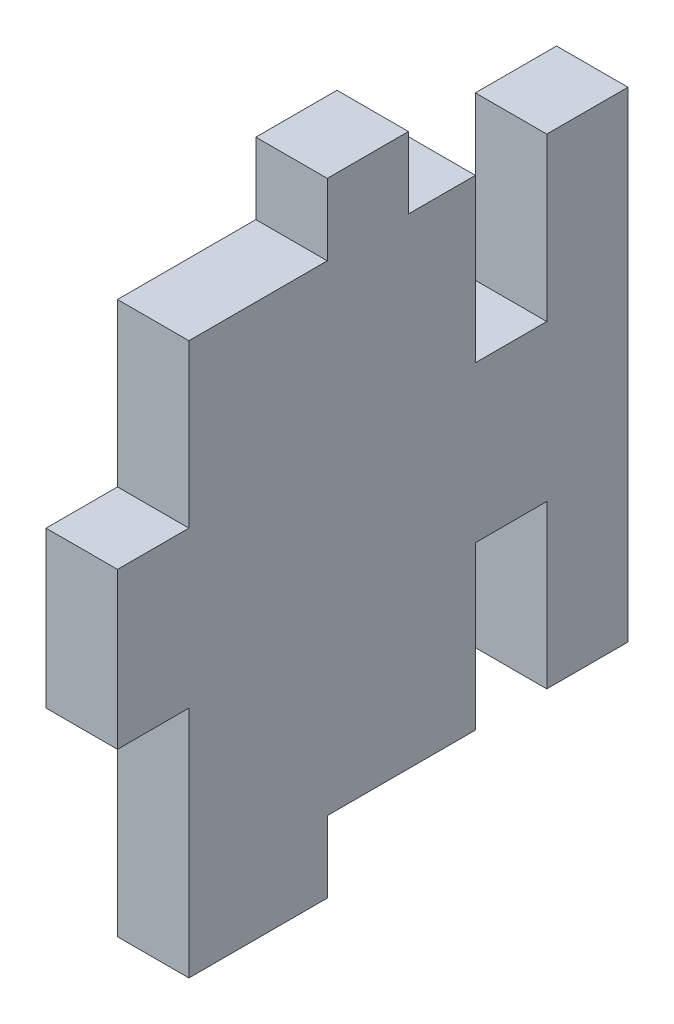
ISO-10303-21;
HEADER;
FILE_DESCRIPTION(('STEP AP214'),'2;1');
FILE_NAME('part.step','',(''),(''),'','','');
FILE_SCHEMA(('AUTOMOTIVE_DESIGN { 1 0 10303 214 1 1 1 1 }'));
ENDSEC;
DATA;
#1=APPLICATION_CONTEXT('core data for automotive mechanical design processes');
#2=APPLICATION_PROTOCOL_DEFINITION('international standard','automotive_design',2000,#1);
#3=PRODUCT_CONTEXT('',#1,'mechanical');
#4=PRODUCT('Part','Part','',(#3));
#5=PRODUCT_RELATED_PRODUCT_CATEGORY('part','',(#4));
#6=PRODUCT_DEFINITION_FORMATION('','',#4);
#7=PRODUCT_DEFINITION_CONTEXT('part definition',#1,'design');
#8=PRODUCT_DEFINITION('design','',#6,#7);
#9=PRODUCT_DEFINITION_SHAPE('','',#8);
#10=(LENGTH_UNIT() NAMED_UNIT(*) SI_UNIT(.MILLI.,.METRE.));
#11=(NAMED_UNIT(*) PLANE_ANGLE_UNIT() SI_UNIT($,.RADIAN.));
#12=(NAMED_UNIT(*) SI_UNIT($,.STERADIAN.) SOLID_ANGLE_UNIT());
#13=UNCERTAINTY_MEASURE_WITH_UNIT(LENGTH_MEASURE(1.E-05),#10,'distance_accuracy_value','');
#14=(GEOMETRIC_REPRESENTATION_CONTEXT(3) GLOBAL_UNCERTAINTY_ASSIGNED_CONTEXT((#13)) GLOBAL_UNIT_ASSIGNED_CONTEXT((#10,
#11,#12)) REPRESENTATION_CONTEXT('',''));
#15=CARTESIAN_POINT('',(0.,0.,0.));
#16=DIRECTION('',(0.,0.,1.));
#17=DIRECTION('',(1.,0.,0.));
#18=AXIS2_PLACEMENT_3D('',#15,#16,#17);
#19=CARTESIAN_POINT('',(5.588,-16.002,0.));
#20=DIRECTION('',(0.,1.,0.));
#21=DIRECTION('',(0.,0.,1.));
#22=AXIS2_PLACEMENT_3D('',#19,#20,#21);
#23=PLANE('',#22);
#24=DIRECTION('',(0.,0.,-1.));
#25=VECTOR('',#24,1.);
#26=CARTESIAN_POINT('',(0.,-16.002,0.));
#27=LINE('',#26,#25);
#28=CARTESIAN_POINT('',(0.,-16.002,3.175));
#29=VERTEX_POINT('',#28);
#30=CARTESIAN_POINT('',(0.,-16.002,-8.412));
#31=VERTEX_POINT('',#30);
#32=EDGE_CURVE('E215',#29,#31,#27,.T.);
#33=ORIENTED_EDGE('',*,*,#32,.T.);
#34=DIRECTION('',(-1.,0.,0.));
#35=VECTOR('',#34,1.);
#36=CARTESIAN_POINT('',(5.588,-16.002,-8.412));
#37=LINE('',#36,#35);
#38=CARTESIAN_POINT('',(5.588,-16.002,-8.412));
#39=VERTEX_POINT('',#38);
#40=EDGE_CURVE('E11',#39,#31,#37,.T.);
#41=ORIENTED_EDGE('',*,*,#40,.F.);
#42=DIRECTION('',(0.,0.,-1.));
#43=VECTOR('',#42,1.);
#44=CARTESIAN_POINT('',(5.588,-16.002,0.));
#45=LINE('',#44,#43);
#46=CARTESIAN_POINT('',(5.588,-16.002,3.175));
#47=VERTEX_POINT('',#46);
#48=EDGE_CURVE('E133',#47,#39,#45,.T.);
#49=ORIENTED_EDGE('',*,*,#48,.F.);
#50=DIRECTION('',(-1.,0.,0.));
#51=VECTOR('',#50,1.);
#52=CARTESIAN_POINT('',(5.588,-16.002,3.175));
#53=LINE('',#52,#51);
#54=EDGE_CURVE('E210',#47,#29,#53,.T.);
#55=ORIENTED_EDGE('',*,*,#54,.T.);
#56=EDGE_LOOP('',(#33,#41,#49,#55));
#57=FACE_BOUND('',#56,.T.);
#58=ADVANCED_FACE('F35',(#57),#23,.F.);
#59=CARTESIAN_POINT('',(5.588,0.,-8.412));
#60=DIRECTION('',(0.,0.,-1.));
#61=DIRECTION('',(-1.,0.,0.));
#62=AXIS2_PLACEMENT_3D('',#59,#60,#61);
#63=PLANE('',#62);
#64=DIRECTION('',(0.,-1.,0.));
#65=VECTOR('',#64,1.);
#66=CARTESIAN_POINT('',(0.,0.,-8.412));
#67=LINE('',#66,#65);
#68=CARTESIAN_POINT('',(0.,-3.302,-8.412));
#69=VERTEX_POINT('',#68);
#70=EDGE_CURVE('E218',#69,#31,#67,.T.);
#71=ORIENTED_EDGE('',*,*,#70,.F.);
#72=DIRECTION('',(-1.,0.,0.));
#73=VECTOR('',#72,1.);
#74=CARTESIAN_POINT('',(5.588,-3.302,-8.412));
#75=LINE('',#74,#73);
#76=CARTESIAN_POINT('',(5.588,-3.302,-8.412));
#77=VERTEX_POINT('',#76);
#78=EDGE_CURVE('E43',#77,#69,#75,.T.);
#79=ORIENTED_EDGE('',*,*,#78,.F.);
#80=DIRECTION('',(0.,-1.,0.));
#81=VECTOR('',#80,1.);
#82=CARTESIAN_POINT('',(5.588,0.,-8.412));
#83=LINE('',#82,#81);
#84=EDGE_CURVE('E663',#77,#39,#83,.T.);
#85=ORIENTED_EDGE('',*,*,#84,.T.);
#86=ORIENTED_EDGE('',*,*,#40,.T.);
#87=EDGE_LOOP('',(#71,#79,#85,#86));
#88=FACE_BOUND('',#87,.T.);
#89=ADVANCED_FACE('F314',(#88),#63,.T.);
#90=CARTESIAN_POINT('',(5.588,-3.302,0.));
#91=DIRECTION('',(0.,-1.,0.));
#92=DIRECTION('',(0.,0.,-1.));
#93=AXIS2_PLACEMENT_3D('',#90,#91,#92);
#94=PLANE('',#93);
#95=DIRECTION('',(0.,0.,1.));
#96=VECTOR('',#95,1.);
#97=CARTESIAN_POINT('',(0.,-3.302,0.));
#98=LINE('',#97,#96);
#99=CARTESIAN_POINT('',(0.,-3.302,-14.));
#100=VERTEX_POINT('',#99);
#101=EDGE_CURVE('E221',#100,#69,#98,.T.);
#102=ORIENTED_EDGE('',*,*,#101,.F.);
#103=DIRECTION('',(-1.,0.,0.));
#104=VECTOR('',#103,1.);
#105=CARTESIAN_POINT('',(5.588,-3.302,-14.));
#106=LINE('',#105,#104);
#107=CARTESIAN_POINT('',(5.588,-3.302,-14.));
#108=VERTEX_POINT('',#107);
#109=EDGE_CURVE('E304',#108,#100,#106,.T.);
#110=ORIENTED_EDGE('',*,*,#109,.F.);
#111=DIRECTION('',(0.,0.,1.));
#112=VECTOR('',#111,1.);
#113=CARTESIAN_POINT('',(5.588,-3.302,0.));
#114=LINE('',#113,#112);
#115=EDGE_CURVE('E311',#108,#77,#114,.T.);
#116=ORIENTED_EDGE('',*,*,#115,.T.);
#117=ORIENTED_EDGE('',*,*,#78,.T.);
#118=EDGE_LOOP('',(#102,#110,#116,#117));
#119=FACE_BOUND('',#118,.T.);
#120=ADVANCED_FACE('F309',(#119),#94,.T.);
#121=CARTESIAN_POINT('',(5.588,0.,-14.));
#122=DIRECTION('',(0.,0.,-1.));
#123=DIRECTION('',(0.,1.,0.));
#124=AXIS2_PLACEMENT_3D('',#121,#122,#123);
#125=PLANE('',#124);
#126=DIRECTION('',(0.,-1.,0.));
#127=VECTOR('',#126,1.);
#128=CARTESIAN_POINT('',(0.,0.,-14.));
#129=LINE('',#128,#127);
#130=CARTESIAN_POINT('',(0.,-16.002,-14.));
#131=VERTEX_POINT('',#130);
#132=EDGE_CURVE('E224',#100,#131,#129,.T.);
#133=ORIENTED_EDGE('',*,*,#132,.T.);
#134=DIRECTION('',(-1.,0.,0.));
#135=VECTOR('',#134,1.);
#136=CARTESIAN_POINT('',(5.588,-16.002,-14.));
#137=LINE('',#136,#135);
#138=CARTESIAN_POINT('',(5.588,-16.002,-14.));
#139=VERTEX_POINT('',#138);
#140=EDGE_CURVE('E301',#139,#131,#137,.T.);
#141=ORIENTED_EDGE('',*,*,#140,.F.);
#142=DIRECTION('',(0.,-1.,0.));
#143=VECTOR('',#142,1.);
#144=CARTESIAN_POINT('',(5.588,0.,-14.));
#145=LINE('',#144,#143);
#146=EDGE_CURVE('E332',#108,#139,#145,.T.);
#147=ORIENTED_EDGE('',*,*,#146,.F.);
#148=ORIENTED_EDGE('',*,*,#109,.T.);
#149=EDGE_LOOP('',(#133,#141,#147,#148));
#150=FACE_BOUND('',#149,.T.);
#151=ADVANCED_FACE('F322',(#150),#125,.F.);
#152=CARTESIAN_POINT('',(5.588,-16.002,0.));
#153=DIRECTION('',(0.,1.,0.));
#154=DIRECTION('',(0.,0.,1.));
#155=AXIS2_PLACEMENT_3D('',#152,#153,#154);
#156=PLANE('',#155);
#157=DIRECTION('',(0.,0.,-1.));
#158=VECTOR('',#157,1.);
#159=CARTESIAN_POINT('',(0.,-16.002,0.));
#160=LINE('',#159,#158);
#161=CARTESIAN_POINT('',(0.,-16.002,-20.35));
#162=VERTEX_POINT('',#161);
#163=EDGE_CURVE('E226',#131,#162,#160,.T.);
#164=ORIENTED_EDGE('',*,*,#163,.T.);
#165=DIRECTION('',(-1.,0.,0.));
#166=VECTOR('',#165,1.);
#167=CARTESIAN_POINT('',(5.588,-16.002,-20.35));
#168=LINE('',#167,#166);
#169=CARTESIAN_POINT('',(5.588,-16.002,-20.35));
#170=VERTEX_POINT('',#169);
#171=EDGE_CURVE('E299',#170,#162,#168,.T.);
#172=ORIENTED_EDGE('',*,*,#171,.F.);
#173=DIRECTION('',(0.,0.,-1.));
#174=VECTOR('',#173,1.);
#175=CARTESIAN_POINT('',(5.588,-16.002,0.));
#176=LINE('',#175,#174);
#177=EDGE_CURVE('E328',#139,#170,#176,.T.);
#178=ORIENTED_EDGE('',*,*,#177,.F.);
#179=ORIENTED_EDGE('',*,*,#140,.T.);
#180=EDGE_LOOP('',(#164,#172,#178,#179));
#181=FACE_BOUND('',#180,.T.);
#182=ADVANCED_FACE('F326',(#181),#156,.F.);
#183=CARTESIAN_POINT('',(5.588,0.,-20.35));
#184=DIRECTION('',(0.,0.,-1.));
#185=DIRECTION('',(0.,1.,0.));
#186=AXIS2_PLACEMENT_3D('',#183,#184,#185);
#187=PLANE('',#186);
#188=DIRECTION('',(0.,-1.,0.));
#189=VECTOR('',#188,1.);
#190=CARTESIAN_POINT('',(0.,0.,-20.35));
#191=LINE('',#190,#189);
#192=CARTESIAN_POINT('',(0.,21.59,-20.35));
#193=VERTEX_POINT('',#192);
#194=EDGE_CURVE('E230',#193,#162,#191,.T.);
#195=ORIENTED_EDGE('',*,*,#194,.F.);
#196=DIRECTION('',(-1.,0.,0.));
#197=VECTOR('',#196,1.);
#198=CARTESIAN_POINT('',(5.588,21.59,-20.35));
#199=LINE('',#198,#197);
#200=CARTESIAN_POINT('',(5.588,21.59,-20.35));
#201=VERTEX_POINT('',#200);
#202=EDGE_CURVE('E297',#201,#193,#199,.T.);
#203=ORIENTED_EDGE('',*,*,#202,.F.);
#204=DIRECTION('',(0.,-1.,0.));
#205=VECTOR('',#204,1.);
#206=CARTESIAN_POINT('',(5.588,0.,-20.35));
#207=LINE('',#206,#205);
#208=EDGE_CURVE('E331',#201,#170,#207,.T.);
#209=ORIENTED_EDGE('',*,*,#208,.T.);
#210=ORIENTED_EDGE('',*,*,#171,.T.);
#211=EDGE_LOOP('',(#195,#203,#209,#210));
#212=FACE_BOUND('',#211,.T.);
#213=ADVANCED_FACE('F389',(#212),#187,.T.);
#214=CARTESIAN_POINT('',(5.588,21.59,0.));
#215=DIRECTION('',(0.,1.,0.));
#216=DIRECTION('',(0.,0.,1.));
#217=AXIS2_PLACEMENT_3D('',#214,#215,#216);
#218=PLANE('',#217);
#219=DIRECTION('',(0.,0.,-1.));
#220=VECTOR('',#219,1.);
#221=CARTESIAN_POINT('',(0.,21.59,0.));
#222=LINE('',#221,#220);
#223=CARTESIAN_POINT('',(0.,21.59,-14.));
#224=VERTEX_POINT('',#223);
#225=EDGE_CURVE('E233',#224,#193,#222,.T.);
#226=ORIENTED_EDGE('',*,*,#225,.F.);
#227=DIRECTION('',(-1.,0.,0.));
#228=VECTOR('',#227,1.);
#229=CARTESIAN_POINT('',(5.588,21.59,-14.));
#230=LINE('',#229,#228);
#231=CARTESIAN_POINT('',(5.588,21.59,-14.));
#232=VERTEX_POINT('',#231);
#233=EDGE_CURVE('E295',#232,#224,#230,.T.);
#234=ORIENTED_EDGE('',*,*,#233,.F.);
#235=DIRECTION('',(0.,0.,-1.));
#236=VECTOR('',#235,1.);
#237=CARTESIAN_POINT('',(5.588,21.59,0.));
#238=LINE('',#237,#236);
#239=EDGE_CURVE('E334',#232,#201,#238,.T.);
#240=ORIENTED_EDGE('',*,*,#239,.T.);
#241=ORIENTED_EDGE('',*,*,#202,.T.);
#242=EDGE_LOOP('',(#226,#234,#240,#241));
#243=FACE_BOUND('',#242,.T.);
#244=ADVANCED_FACE('F392',(#243),#218,.T.);
#245=CARTESIAN_POINT('',(0.,8.89,-14.));
#246=VERTEX_POINT('',#245);
#247=EDGE_CURVE('E227',#224,#246,#129,.T.);
#248=ORIENTED_EDGE('',*,*,#247,.T.);
#249=DIRECTION('',(-1.,0.,0.));
#250=VECTOR('',#249,1.);
#251=CARTESIAN_POINT('',(5.588,8.89,-14.));
#252=LINE('',#251,#250);
#253=CARTESIAN_POINT('',(5.588,8.89,-14.));
#254=VERTEX_POINT('',#253);
#255=EDGE_CURVE('E292',#254,#246,#252,.T.);
#256=ORIENTED_EDGE('',*,*,#255,.F.);
#257=EDGE_CURVE('E337',#232,#254,#145,.T.);
#258=ORIENTED_EDGE('',*,*,#257,.F.);
#259=ORIENTED_EDGE('',*,*,#233,.T.);
#260=EDGE_LOOP('',(#248,#256,#258,#259));
#261=FACE_BOUND('',#260,.T.);
#262=ADVANCED_FACE('F396',(#261),#125,.F.);
#263=CARTESIAN_POINT('',(5.588,8.89,0.));
#264=DIRECTION('',(0.,-1.,0.));
#265=DIRECTION('',(0.,0.,-1.));
#266=AXIS2_PLACEMENT_3D('',#263,#264,#265);
#267=PLANE('',#266);
#268=DIRECTION('',(0.,0.,1.));
#269=VECTOR('',#268,1.);
#270=CARTESIAN_POINT('',(0.,8.89,0.));
#271=LINE('',#270,#269);
#272=CARTESIAN_POINT('',(0.,8.89,-8.412));
#273=VERTEX_POINT('',#272);
#274=EDGE_CURVE('E236',#246,#273,#271,.T.);
#275=ORIENTED_EDGE('',*,*,#274,.T.);
#276=DIRECTION('',(-1.,0.,0.));
#277=VECTOR('',#276,1.);
#278=CARTESIAN_POINT('',(5.588,8.89,-8.412));
#279=LINE('',#278,#277);
#280=CARTESIAN_POINT('',(5.588,8.89,-8.412));
#281=VERTEX_POINT('',#280);
#282=EDGE_CURVE('E290',#281,#273,#279,.T.);
#283=ORIENTED_EDGE('',*,*,#282,.F.);
#284=DIRECTION('',(0.,0.,1.));
#285=VECTOR('',#284,1.);
#286=CARTESIAN_POINT('',(5.588,8.89,0.));
#287=LINE('',#286,#285);
#288=EDGE_CURVE('E342',#254,#281,#287,.T.);
#289=ORIENTED_EDGE('',*,*,#288,.F.);
#290=ORIENTED_EDGE('',*,*,#255,.T.);
#291=EDGE_LOOP('',(#275,#283,#289,#290));
#292=FACE_BOUND('',#291,.T.);
#293=ADVANCED_FACE('F400',(#292),#267,.F.);
#294=CARTESIAN_POINT('',(5.588,0.,-8.412));
#295=DIRECTION('',(0.,0.,-1.));
#296=DIRECTION('',(-1.,0.,0.));
#297=AXIS2_PLACEMENT_3D('',#294,#295,#296);
#298=PLANE('',#297);
#299=DIRECTION('',(0.,-1.,0.));
#300=VECTOR('',#299,1.);
#301=CARTESIAN_POINT('',(0.,0.,-8.412));
#302=LINE('',#301,#300);
#303=CARTESIAN_POINT('',(0.,21.59,-8.412));
#304=VERTEX_POINT('',#303);
#305=EDGE_CURVE('E239',#304,#273,#302,.T.);
#306=ORIENTED_EDGE('',*,*,#305,.F.);
#307=DIRECTION('',(-1.,0.,0.));
#308=VECTOR('',#307,1.);
#309=CARTESIAN_POINT('',(5.588,21.59,-8.412));
#310=LINE('',#309,#308);
#311=CARTESIAN_POINT('',(5.588,21.59,-8.412));
#312=VERTEX_POINT('',#311);
#313=EDGE_CURVE('E288',#312,#304,#310,.T.);
#314=ORIENTED_EDGE('',*,*,#313,.F.);
#315=DIRECTION('',(0.,-1.,0.));
#316=VECTOR('',#315,1.);
#317=CARTESIAN_POINT('',(5.588,0.,-8.412));
#318=LINE('',#317,#316);
#319=EDGE_CURVE('E344',#312,#281,#318,.T.);
#320=ORIENTED_EDGE('',*,*,#319,.T.);
#321=ORIENTED_EDGE('',*,*,#282,.T.);
#322=EDGE_LOOP('',(#306,#314,#320,#321));
#323=FACE_BOUND('',#322,.T.);
#324=ADVANCED_FACE('F404',(#323),#298,.T.);
#325=CARTESIAN_POINT('',(5.588,21.59,0.));
#326=DIRECTION('',(0.,1.,0.));
#327=DIRECTION('',(0.,0.,1.));
#328=AXIS2_PLACEMENT_3D('',#325,#326,#327);
#329=PLANE('',#328);
#330=DIRECTION('',(0.,0.,-1.));
#331=VECTOR('',#330,1.);
#332=CARTESIAN_POINT('',(0.,21.59,0.));
#333=LINE('',#332,#331);
#334=CARTESIAN_POINT('',(0.,21.59,-3.175));
#335=VERTEX_POINT('',#334);
#336=EDGE_CURVE('E242',#335,#304,#333,.T.);
#337=ORIENTED_EDGE('',*,*,#336,.F.);
#338=DIRECTION('',(-1.,0.,0.));
#339=VECTOR('',#338,1.);
#340=CARTESIAN_POINT('',(5.588,21.59,-3.175));
#341=LINE('',#340,#339);
#342=CARTESIAN_POINT('',(5.588,21.59,-3.175));
#343=VERTEX_POINT('',#342);
#344=EDGE_CURVE('E286',#343,#335,#341,.T.);
#345=ORIENTED_EDGE('',*,*,#344,.F.);
#346=DIRECTION('',(0.,0.,-1.));
#347=VECTOR('',#346,1.);
#348=CARTESIAN_POINT('',(5.588,21.59,0.));
#349=LINE('',#348,#347);
#350=EDGE_CURVE('E347',#343,#312,#349,.T.);
#351=ORIENTED_EDGE('',*,*,#350,.T.);
#352=ORIENTED_EDGE('',*,*,#313,.T.);
#353=EDGE_LOOP('',(#337,#345,#351,#352));
#354=FACE_BOUND('',#353,.T.);
#355=ADVANCED_FACE('F408',(#354),#329,.T.);
#356=CARTESIAN_POINT('',(5.588,0.,-3.175));
#357=DIRECTION('',(0.,0.,1.));
#358=DIRECTION('',(1.,0.,0.));
#359=AXIS2_PLACEMENT_3D('',#356,#357,#358);
#360=PLANE('',#359);
#361=DIRECTION('',(0.,1.,0.));
#362=VECTOR('',#361,1.);
#363=CARTESIAN_POINT('',(0.,0.,-3.175));
#364=LINE('',#363,#362);
#365=CARTESIAN_POINT('',(0.,27.178,-3.175));
#366=VERTEX_POINT('',#365);
#367=EDGE_CURVE('E245',#335,#366,#364,.T.);
#368=ORIENTED_EDGE('',*,*,#367,.T.);
#369=DIRECTION('',(-1.,0.,0.));
#370=VECTOR('',#369,1.);
#371=CARTESIAN_POINT('',(5.588,27.178,-3.175));
#372=LINE('',#371,#370);
#373=CARTESIAN_POINT('',(5.588,27.178,-3.175));
#374=VERTEX_POINT('',#373);
#375=EDGE_CURVE('E284',#374,#366,#372,.T.);
#376=ORIENTED_EDGE('',*,*,#375,.F.);
#377=DIRECTION('',(0.,1.,0.));
#378=VECTOR('',#377,1.);
#379=CARTESIAN_POINT('',(5.588,0.,-3.175));
#380=LINE('',#379,#378);
#381=EDGE_CURVE('E350',#343,#374,#380,.T.);
#382=ORIENTED_EDGE('',*,*,#381,.F.);
#383=ORIENTED_EDGE('',*,*,#344,.T.);
#384=EDGE_LOOP('',(#368,#376,#382,#383));
#385=FACE_BOUND('',#384,.T.);
#386=ADVANCED_FACE('F410',(#385),#360,.F.);
#387=CARTESIAN_POINT('',(5.588,27.178,0.));
#388=DIRECTION('',(0.,1.,0.));
#389=DIRECTION('',(0.,0.,1.));
#390=AXIS2_PLACEMENT_3D('',#387,#388,#389);
#391=PLANE('',#390);
#392=DIRECTION('',(0.,0.,-1.));
#393=VECTOR('',#392,1.);
#394=CARTESIAN_POINT('',(0.,27.178,0.));
#395=LINE('',#394,#393);
#396=CARTESIAN_POINT('',(0.,27.178,3.175));
#397=VERTEX_POINT('',#396);
#398=EDGE_CURVE('E249',#397,#366,#395,.T.);
#399=ORIENTED_EDGE('',*,*,#398,.F.);
#400=DIRECTION('',(-1.,0.,0.));
#401=VECTOR('',#400,1.);
#402=CARTESIAN_POINT('',(5.588,27.178,3.175));
#403=LINE('',#402,#401);
#404=CARTESIAN_POINT('',(5.588,27.178,3.175));
#405=VERTEX_POINT('',#404);
#406=EDGE_CURVE('E282',#405,#397,#403,.T.);
#407=ORIENTED_EDGE('',*,*,#406,.F.);
#408=DIRECTION('',(0.,0.,-1.));
#409=VECTOR('',#408,1.);
#410=CARTESIAN_POINT('',(5.588,27.178,0.));
#411=LINE('',#410,#409);
#412=EDGE_CURVE('E353',#405,#374,#411,.T.);
#413=ORIENTED_EDGE('',*,*,#412,.T.);
#414=ORIENTED_EDGE('',*,*,#375,.T.);
#415=EDGE_LOOP('',(#399,#407,#413,#414));
#416=FACE_BOUND('',#415,.T.);
#417=ADVANCED_FACE('F413',(#416),#391,.T.);
#418=CARTESIAN_POINT('',(5.588,0.,3.175));
#419=DIRECTION('',(0.,0.,1.));
#420=DIRECTION('',(1.,0.,0.));
#421=AXIS2_PLACEMENT_3D('',#418,#419,#420);
#422=PLANE('',#421);
#423=DIRECTION('',(0.,1.,0.));
#424=VECTOR('',#423,1.);
#425=CARTESIAN_POINT('',(0.,0.,3.175));
#426=LINE('',#425,#424);
#427=CARTESIAN_POINT('',(0.,21.59,3.175));
#428=VERTEX_POINT('',#427);
#429=EDGE_CURVE('E252',#428,#397,#426,.T.);
#430=ORIENTED_EDGE('',*,*,#429,.F.);
#431=DIRECTION('',(-1.,0.,0.));
#432=VECTOR('',#431,1.);
#433=CARTESIAN_POINT('',(5.588,21.59,3.175));
#434=LINE('',#433,#432);
#435=CARTESIAN_POINT('',(5.588,21.59,3.175));
#436=VERTEX_POINT('',#435);
#437=EDGE_CURVE('E280',#436,#428,#434,.T.);
#438=ORIENTED_EDGE('',*,*,#437,.F.);
#439=DIRECTION('',(0.,1.,0.));
#440=VECTOR('',#439,1.);
#441=CARTESIAN_POINT('',(5.588,0.,3.175));
#442=LINE('',#441,#440);
#443=EDGE_CURVE('E356',#436,#405,#442,.T.);
#444=ORIENTED_EDGE('',*,*,#443,.T.);
#445=ORIENTED_EDGE('',*,*,#406,.T.);
#446=EDGE_LOOP('',(#430,#438,#444,#445));
#447=FACE_BOUND('',#446,.T.);
#448=ADVANCED_FACE('F417',(#447),#422,.T.);
#449=CARTESIAN_POINT('',(0.,21.59,14.));
#450=VERTEX_POINT('',#449);
#451=EDGE_CURVE('E246',#450,#428,#333,.T.);
#452=ORIENTED_EDGE('',*,*,#451,.F.);
#453=DIRECTION('',(-1.,0.,0.));
#454=VECTOR('',#453,1.);
#455=CARTESIAN_POINT('',(5.588,21.59,14.));
#456=LINE('',#455,#454);
#457=CARTESIAN_POINT('',(5.588,21.59,14.));
#458=VERTEX_POINT('',#457);
#459=EDGE_CURVE('E278',#458,#450,#456,.T.);
#460=ORIENTED_EDGE('',*,*,#459,.F.);
#461=EDGE_CURVE('E351',#458,#436,#349,.T.);
#462=ORIENTED_EDGE('',*,*,#461,.T.);
#463=ORIENTED_EDGE('',*,*,#437,.T.);
#464=EDGE_LOOP('',(#452,#460,#462,#463));
#465=FACE_BOUND('',#464,.T.);
#466=ADVANCED_FACE('F421',(#465),#329,.T.);
#467=CARTESIAN_POINT('',(5.588,0.,14.));
#468=DIRECTION('',(0.,0.,-1.));
#469=DIRECTION('',(0.,1.,0.));
#470=AXIS2_PLACEMENT_3D('',#467,#468,#469);
#471=PLANE('',#470);
#472=DIRECTION('',(0.,-1.,0.));
#473=VECTOR('',#472,1.);
#474=CARTESIAN_POINT('',(0.,0.,14.));
#475=LINE('',#474,#473);
#476=CARTESIAN_POINT('',(0.,8.89,14.));
#477=VERTEX_POINT('',#476);
#478=EDGE_CURVE('E255',#450,#477,#475,.T.);
#479=ORIENTED_EDGE('',*,*,#478,.T.);
#480=DIRECTION('',(-1.,0.,0.));
#481=VECTOR('',#480,1.);
#482=CARTESIAN_POINT('',(5.588,8.89,14.));
#483=LINE('',#482,#481);
#484=CARTESIAN_POINT('',(5.588,8.89,14.));
#485=VERTEX_POINT('',#484);
#486=EDGE_CURVE('E275',#485,#477,#483,.T.);
#487=ORIENTED_EDGE('',*,*,#486,.F.);
#488=DIRECTION('',(0.,-1.,0.));
#489=VECTOR('',#488,1.);
#490=CARTESIAN_POINT('',(5.588,0.,14.));
#491=LINE('',#490,#489);
#492=EDGE_CURVE('E200',#458,#485,#491,.T.);
#493=ORIENTED_EDGE('',*,*,#492,.F.);
#494=ORIENTED_EDGE('',*,*,#459,.T.);
#495=EDGE_LOOP('',(#479,#487,#493,#494));
#496=FACE_BOUND('',#495,.T.);
#497=ADVANCED_FACE('F425',(#496),#471,.F.);
#498=CARTESIAN_POINT('',(5.588,8.89000000000001,0.));
#499=DIRECTION('',(0.,-1.,0.));
#500=DIRECTION('',(0.,0.,-1.));
#501=AXIS2_PLACEMENT_3D('',#498,#499,#500);
#502=PLANE('',#501);
#503=DIRECTION('',(0.,0.,1.));
#504=VECTOR('',#503,1.);
#505=CARTESIAN_POINT('',(0.,8.89000000000001,0.));
#506=LINE('',#505,#504);
#507=CARTESIAN_POINT('',(0.,8.89,19.588));
#508=VERTEX_POINT('',#507);
#509=EDGE_CURVE('E257',#477,#508,#506,.T.);
#510=ORIENTED_EDGE('',*,*,#509,.T.);
#511=DIRECTION('',(-1.,0.,0.));
#512=VECTOR('',#511,1.);
#513=CARTESIAN_POINT('',(5.588,8.89,19.588));
#514=LINE('',#513,#512);
#515=CARTESIAN_POINT('',(5.588,8.89,19.588));
#516=VERTEX_POINT('',#515);
#517=EDGE_CURVE('E272',#516,#508,#514,.T.);
#518=ORIENTED_EDGE('',*,*,#517,.F.);
#519=DIRECTION('',(0.,0.,1.));
#520=VECTOR('',#519,1.);
#521=CARTESIAN_POINT('',(5.588,8.89000000000001,0.));
#522=LINE('',#521,#520);
#523=EDGE_CURVE('E359',#485,#516,#522,.T.);
#524=ORIENTED_EDGE('',*,*,#523,.F.);
#525=ORIENTED_EDGE('',*,*,#486,.T.);
#526=EDGE_LOOP('',(#510,#518,#524,#525));
#527=FACE_BOUND('',#526,.T.);
#528=ADVANCED_FACE('F427',(#527),#502,.F.);
#529=CARTESIAN_POINT('',(5.588,0.,19.588));
#530=DIRECTION('',(0.,0.,-1.));
#531=DIRECTION('',(-1.,0.,0.));
#532=AXIS2_PLACEMENT_3D('',#529,#530,#531);
#533=PLANE('',#532);
#534=DIRECTION('',(0.,-1.,0.));
#535=VECTOR('',#534,1.);
#536=CARTESIAN_POINT('',(0.,0.,19.588));
#537=LINE('',#536,#535);
#538=CARTESIAN_POINT('',(0.,-3.30200000000001,19.588));
#539=VERTEX_POINT('',#538);
#540=EDGE_CURVE('E259',#508,#539,#537,.T.);
#541=ORIENTED_EDGE('',*,*,#540,.T.);
#542=DIRECTION('',(-1.,0.,0.));
#543=VECTOR('',#542,1.);
#544=CARTESIAN_POINT('',(5.588,-3.30200000000001,19.588));
#545=LINE('',#544,#543);
#546=CARTESIAN_POINT('',(5.588,-3.30200000000001,19.588));
#547=VERTEX_POINT('',#546);
#548=EDGE_CURVE('E270',#547,#539,#545,.T.);
#549=ORIENTED_EDGE('',*,*,#548,.F.);
#550=DIRECTION('',(0.,-1.,0.));
#551=VECTOR('',#550,1.);
#552=CARTESIAN_POINT('',(5.588,0.,19.588));
#553=LINE('',#552,#551);
#554=EDGE_CURVE('E360',#516,#547,#553,.T.);
#555=ORIENTED_EDGE('',*,*,#554,.F.);
#556=ORIENTED_EDGE('',*,*,#517,.T.);
#557=EDGE_LOOP('',(#541,#549,#555,#556));
#558=FACE_BOUND('',#557,.T.);
#559=ADVANCED_FACE('F430',(#558),#533,.F.);
#560=CARTESIAN_POINT('',(5.588,-3.30199999999999,0.));
#561=DIRECTION('',(0.,-1.,0.));
#562=DIRECTION('',(0.,0.,-1.));
#563=AXIS2_PLACEMENT_3D('',#560,#561,#562);
#564=PLANE('',#563);
#565=DIRECTION('',(0.,0.,1.));
#566=VECTOR('',#565,1.);
#567=CARTESIAN_POINT('',(0.,-3.30199999999999,0.));
#568=LINE('',#567,#566);
#569=CARTESIAN_POINT('',(0.,-3.302,14.));
#570=VERTEX_POINT('',#569);
#571=EDGE_CURVE('E262',#570,#539,#568,.T.);
#572=ORIENTED_EDGE('',*,*,#571,.F.);
#573=DIRECTION('',(-1.,0.,0.));
#574=VECTOR('',#573,1.);
#575=CARTESIAN_POINT('',(5.588,-3.302,14.));
#576=LINE('',#575,#574);
#577=CARTESIAN_POINT('',(5.588,-3.302,14.));
#578=VERTEX_POINT('',#577);
#579=EDGE_CURVE('E205',#578,#570,#576,.T.);
#580=ORIENTED_EDGE('',*,*,#579,.F.);
#581=DIRECTION('',(0.,0.,1.));
#582=VECTOR('',#581,1.);
#583=CARTESIAN_POINT('',(5.588,-3.30199999999999,0.));
#584=LINE('',#583,#582);
#585=EDGE_CURVE('E197',#578,#547,#584,.T.);
#586=ORIENTED_EDGE('',*,*,#585,.T.);
#587=ORIENTED_EDGE('',*,*,#548,.T.);
#588=EDGE_LOOP('',(#572,#580,#586,#587));
#589=FACE_BOUND('',#588,.T.);
#590=ADVANCED_FACE('F365',(#589),#564,.T.);
#591=CARTESIAN_POINT('',(0.,-21.59,14.));
#592=VERTEX_POINT('',#591);
#593=EDGE_CURVE('E204',#570,#592,#475,.T.);
#594=ORIENTED_EDGE('',*,*,#593,.T.);
#595=DIRECTION('',(-1.,0.,0.));
#596=VECTOR('',#595,1.);
#597=CARTESIAN_POINT('',(5.588,-21.59,14.));
#598=LINE('',#597,#596);
#599=CARTESIAN_POINT('',(5.588,-21.59,14.));
#600=VERTEX_POINT('',#599);
#601=EDGE_CURVE('E201',#600,#592,#598,.T.);
#602=ORIENTED_EDGE('',*,*,#601,.F.);
#603=EDGE_CURVE('E191',#578,#600,#491,.T.);
#604=ORIENTED_EDGE('',*,*,#603,.F.);
#605=ORIENTED_EDGE('',*,*,#579,.T.);
#606=EDGE_LOOP('',(#594,#602,#604,#605));
#607=FACE_BOUND('',#606,.T.);
#608=ADVANCED_FACE('F202',(#607),#471,.F.);
#609=CARTESIAN_POINT('',(5.588,-21.59,0.));
#610=DIRECTION('',(0.,1.,0.));
#611=DIRECTION('',(0.,0.,1.));
#612=AXIS2_PLACEMENT_3D('',#609,#610,#611);
#613=PLANE('',#612);
#614=DIRECTION('',(0.,0.,-1.));
#615=VECTOR('',#614,1.);
#616=CARTESIAN_POINT('',(0.,-21.59,0.));
#617=LINE('',#616,#615);
#618=CARTESIAN_POINT('',(0.,-21.59,3.175));
#619=VERTEX_POINT('',#618);
#620=EDGE_CURVE('E121',#592,#619,#617,.T.);
#621=ORIENTED_EDGE('',*,*,#620,.T.);
#622=DIRECTION('',(-1.,0.,0.));
#623=VECTOR('',#622,1.);
#624=CARTESIAN_POINT('',(5.588,-21.59,3.175));
#625=LINE('',#624,#623);
#626=CARTESIAN_POINT('',(5.588,-21.59,3.175));
#627=VERTEX_POINT('',#626);
#628=EDGE_CURVE('E206',#627,#619,#625,.T.);
#629=ORIENTED_EDGE('',*,*,#628,.F.);
#630=DIRECTION('',(0.,0.,-1.));
#631=VECTOR('',#630,1.);
#632=CARTESIAN_POINT('',(5.588,-21.59,0.));
#633=LINE('',#632,#631);
#634=EDGE_CURVE('E195',#600,#627,#633,.T.);
#635=ORIENTED_EDGE('',*,*,#634,.F.);
#636=ORIENTED_EDGE('',*,*,#601,.T.);
#637=EDGE_LOOP('',(#621,#629,#635,#636));
#638=FACE_BOUND('',#637,.T.);
#639=ADVANCED_FACE('F208',(#638),#613,.F.);
#640=CARTESIAN_POINT('',(5.588,0.,3.175));
#641=DIRECTION('',(0.,0.,1.));
#642=DIRECTION('',(0.,-1.,0.));
#643=AXIS2_PLACEMENT_3D('',#640,#641,#642);
#644=PLANE('',#643);
#645=DIRECTION('',(0.,1.,0.));
#646=VECTOR('',#645,1.);
#647=CARTESIAN_POINT('',(0.,0.,3.175));
#648=LINE('',#647,#646);
#649=EDGE_CURVE('E127',#619,#29,#648,.T.);
#650=ORIENTED_EDGE('',*,*,#649,.T.);
#651=ORIENTED_EDGE('',*,*,#54,.F.);
#652=DIRECTION('',(0.,1.,0.));
#653=VECTOR('',#652,1.);
#654=CARTESIAN_POINT('',(5.588,0.,3.175));
#655=LINE('',#654,#653);
#656=EDGE_CURVE('E51',#627,#47,#655,.T.);
#657=ORIENTED_EDGE('',*,*,#656,.F.);
#658=ORIENTED_EDGE('',*,*,#628,.T.);
#659=EDGE_LOOP('',(#650,#651,#657,#658));
#660=FACE_BOUND('',#659,.T.);
#661=ADVANCED_FACE('F368',(#660),#644,.F.);
#662=CARTESIAN_POINT('',(5.588,0.,0.));
#663=DIRECTION('',(1.,0.,0.));
#664=DIRECTION('',(0.,0.,-1.));
#665=AXIS2_PLACEMENT_3D('',#662,#663,#664);
#666=PLANE('',#665);
#667=ORIENTED_EDGE('',*,*,#48,.T.);
#668=ORIENTED_EDGE('',*,*,#84,.F.);
#669=ORIENTED_EDGE('',*,*,#115,.F.);
#670=ORIENTED_EDGE('',*,*,#146,.T.);
#671=ORIENTED_EDGE('',*,*,#177,.T.);
#672=ORIENTED_EDGE('',*,*,#208,.F.);
#673=ORIENTED_EDGE('',*,*,#239,.F.);
#674=ORIENTED_EDGE('',*,*,#257,.T.);
#675=ORIENTED_EDGE('',*,*,#288,.T.);
#676=ORIENTED_EDGE('',*,*,#319,.F.);
#677=ORIENTED_EDGE('',*,*,#350,.F.);
#678=ORIENTED_EDGE('',*,*,#381,.T.);
#679=ORIENTED_EDGE('',*,*,#412,.F.);
#680=ORIENTED_EDGE('',*,*,#443,.F.);
#681=ORIENTED_EDGE('',*,*,#461,.F.);
#682=ORIENTED_EDGE('',*,*,#492,.T.);
#683=ORIENTED_EDGE('',*,*,#523,.T.);
#684=ORIENTED_EDGE('',*,*,#554,.T.);
#685=ORIENTED_EDGE('',*,*,#585,.F.);
#686=ORIENTED_EDGE('',*,*,#603,.T.);
#687=ORIENTED_EDGE('',*,*,#634,.T.);
#688=ORIENTED_EDGE('',*,*,#656,.T.);
#689=EDGE_LOOP('',(#667,#668,#669,#670,#671,#672,#673,#674,#675,#676,#677,#678,#679,#680,#681,
#682,#683,#684,#685,#686,#687,#688));
#690=FACE_BOUND('',#689,.T.);
#691=ADVANCED_FACE('F193',(#690),#666,.T.);
#692=CARTESIAN_POINT('',(0.,0.,0.));
#693=DIRECTION('',(1.,0.,0.));
#694=DIRECTION('',(0.,0.,-1.));
#695=AXIS2_PLACEMENT_3D('',#692,#693,#694);
#696=PLANE('',#695);
#697=ORIENTED_EDGE('',*,*,#32,.F.);
#698=ORIENTED_EDGE('',*,*,#649,.F.);
#699=ORIENTED_EDGE('',*,*,#620,.F.);
#700=ORIENTED_EDGE('',*,*,#593,.F.);
#701=ORIENTED_EDGE('',*,*,#571,.T.);
#702=ORIENTED_EDGE('',*,*,#540,.F.);
#703=ORIENTED_EDGE('',*,*,#509,.F.);
#704=ORIENTED_EDGE('',*,*,#478,.F.);
#705=ORIENTED_EDGE('',*,*,#451,.T.);
#706=ORIENTED_EDGE('',*,*,#429,.T.);
#707=ORIENTED_EDGE('',*,*,#398,.T.);
#708=ORIENTED_EDGE('',*,*,#367,.F.);
#709=ORIENTED_EDGE('',*,*,#336,.T.);
#710=ORIENTED_EDGE('',*,*,#305,.T.);
#711=ORIENTED_EDGE('',*,*,#274,.F.);
#712=ORIENTED_EDGE('',*,*,#247,.F.);
#713=ORIENTED_EDGE('',*,*,#225,.T.);
#714=ORIENTED_EDGE('',*,*,#194,.T.);
#715=ORIENTED_EDGE('',*,*,#163,.F.);
#716=ORIENTED_EDGE('',*,*,#132,.F.);
#717=ORIENTED_EDGE('',*,*,#101,.T.);
#718=ORIENTED_EDGE('',*,*,#70,.T.);
#719=EDGE_LOOP('',(#697,#698,#699,#700,#701,#702,#703,#704,#705,#706,#707,#708,#709,#710,#711,
#712,#713,#714,#715,#716,#717,#718));
#720=FACE_BOUND('',#719,.T.);
#721=ADVANCED_FACE('F318',(#720),#696,.F.);
#722=CLOSED_SHELL('',(#58,#89,#120,#151,#182,#213,#244,#262,#293,#324,#355,#386,#417,#448,#466,
#497,#528,#559,#590,#608,#639,#661,#691,#721));
#723=MANIFOLD_SOLID_BREP('B2',#722);
#724=ADVANCED_BREP_SHAPE_REPRESENTATION('',(#18,#723),#14);
#725=SHAPE_DEFINITION_REPRESENTATION(#9,#724);
ENDSEC;
END-ISO-10303-21;
